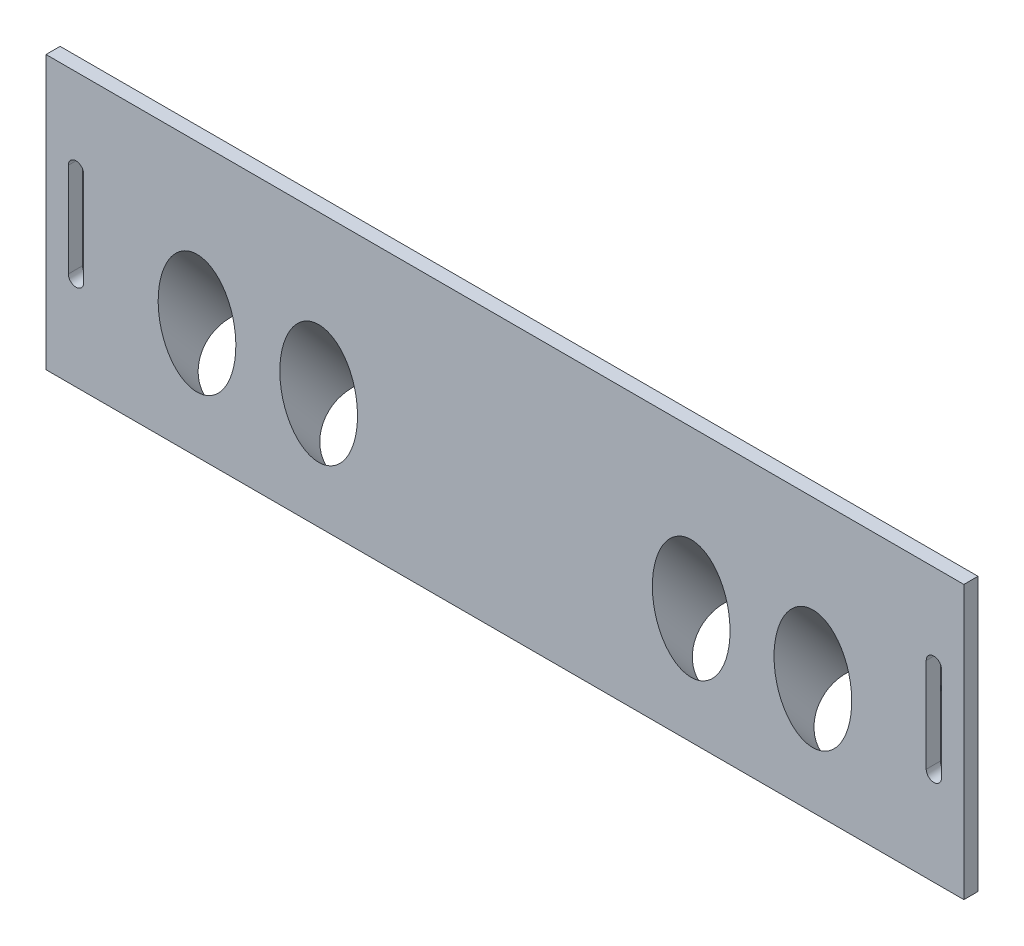
ISO-10303-21;
HEADER;
FILE_DESCRIPTION(('STEP AP214'),'2;1');
FILE_NAME('part.step','',(''),(''),'','','');
FILE_SCHEMA(('AUTOMOTIVE_DESIGN { 1 0 10303 214 1 1 1 1 }'));
ENDSEC;
DATA;
#1=APPLICATION_CONTEXT('core data for automotive mechanical design processes');
#2=APPLICATION_PROTOCOL_DEFINITION('international standard','automotive_design',2000,#1);
#3=PRODUCT_CONTEXT('',#1,'mechanical');
#4=PRODUCT('Part','Part','',(#3));
#5=PRODUCT_RELATED_PRODUCT_CATEGORY('part','',(#4));
#6=PRODUCT_DEFINITION_FORMATION('','',#4);
#7=PRODUCT_DEFINITION_CONTEXT('part definition',#1,'design');
#8=PRODUCT_DEFINITION('design','',#6,#7);
#9=PRODUCT_DEFINITION_SHAPE('','',#8);
#10=(LENGTH_UNIT() NAMED_UNIT(*) SI_UNIT(.MILLI.,.METRE.));
#11=(NAMED_UNIT(*) PLANE_ANGLE_UNIT() SI_UNIT($,.RADIAN.));
#12=(NAMED_UNIT(*) SI_UNIT($,.STERADIAN.) SOLID_ANGLE_UNIT());
#13=UNCERTAINTY_MEASURE_WITH_UNIT(LENGTH_MEASURE(1.E-05),#10,'distance_accuracy_value','');
#14=(GEOMETRIC_REPRESENTATION_CONTEXT(3) GLOBAL_UNCERTAINTY_ASSIGNED_CONTEXT((#13)) GLOBAL_UNIT_ASSIGNED_CONTEXT((#10,
#11,#12)) REPRESENTATION_CONTEXT('',''));
#15=CARTESIAN_POINT('',(0.,0.,0.));
#16=DIRECTION('',(0.,0.,1.));
#17=DIRECTION('',(1.,0.,0.));
#18=AXIS2_PLACEMENT_3D('',#15,#16,#17);
#19=CARTESIAN_POINT('',(91.125,15.,3.));
#20=DIRECTION('',(0.,0.,-1.));
#21=DIRECTION('',(-1.,0.,0.));
#22=AXIS2_PLACEMENT_3D('',#19,#20,#21);
#23=CYLINDRICAL_SURFACE('',#22,1.625);
#24=CARTESIAN_POINT('',(91.125,15.,3.));
#25=DIRECTION('',(0.,0.,1.));
#26=DIRECTION('',(1.,0.,0.));
#27=AXIS2_PLACEMENT_3D('',#24,#25,#26);
#28=CIRCLE('',#27,1.625);
#29=CARTESIAN_POINT('',(89.5,15.,3.));
#30=VERTEX_POINT('',#29);
#31=CARTESIAN_POINT('',(92.75,15.,3.));
#32=VERTEX_POINT('',#31);
#33=EDGE_CURVE('E184',#30,#32,#28,.T.);
#34=ORIENTED_EDGE('',*,*,#33,.T.);
#35=DIRECTION('',(0.,0.,-1.));
#36=VECTOR('',#35,1.);
#37=CARTESIAN_POINT('',(92.75,15.,3.));
#38=LINE('',#37,#36);
#39=CARTESIAN_POINT('',(92.75,15.,0.));
#40=VERTEX_POINT('',#39);
#41=EDGE_CURVE('E170',#32,#40,#38,.T.);
#42=ORIENTED_EDGE('',*,*,#41,.T.);
#43=CARTESIAN_POINT('',(91.125,15.,0.));
#44=DIRECTION('',(0.,0.,1.));
#45=DIRECTION('',(1.,0.,0.));
#46=AXIS2_PLACEMENT_3D('',#43,#44,#45);
#47=CIRCLE('',#46,1.625);
#48=CARTESIAN_POINT('',(89.5,15.,0.));
#49=VERTEX_POINT('',#48);
#50=EDGE_CURVE('E178',#49,#40,#47,.T.);
#51=ORIENTED_EDGE('',*,*,#50,.F.);
#52=DIRECTION('',(0.,0.,-1.));
#53=VECTOR('',#52,1.);
#54=CARTESIAN_POINT('',(89.5,15.,3.));
#55=LINE('',#54,#53);
#56=EDGE_CURVE('E161',#30,#49,#55,.T.);
#57=ORIENTED_EDGE('',*,*,#56,.F.);
#58=EDGE_LOOP('',(#34,#42,#51,#57));
#59=FACE_BOUND('',#58,.T.);
#60=ADVANCED_FACE('F38',(#59),#23,.F.);
#61=CARTESIAN_POINT('',(0.,0.,0.));
#62=DIRECTION('',(0.,0.,1.));
#63=DIRECTION('',(1.,0.,0.));
#64=AXIS2_PLACEMENT_3D('',#61,#62,#63);
#65=PLANE('',#64);
#66=CARTESIAN_POINT('',(-91.125,35.,0.));
#67=DIRECTION('',(0.,0.,-1.));
#68=DIRECTION('',(1.,0.,0.));
#69=AXIS2_PLACEMENT_3D('',#66,#67,#68);
#70=CIRCLE('',#69,1.625);
#71=CARTESIAN_POINT('',(-92.75,35.,0.));
#72=VERTEX_POINT('',#71);
#73=CARTESIAN_POINT('',(-89.5,35.,0.));
#74=VERTEX_POINT('',#73);
#75=EDGE_CURVE('E334',#72,#74,#70,.T.);
#76=ORIENTED_EDGE('',*,*,#75,.F.);
#77=DIRECTION('',(0.,1.,0.));
#78=VECTOR('',#77,1.);
#79=CARTESIAN_POINT('',(-92.75,15.,0.));
#80=LINE('',#79,#78);
#81=CARTESIAN_POINT('',(-92.75,15.,0.));
#82=VERTEX_POINT('',#81);
#83=EDGE_CURVE('E220',#82,#72,#80,.T.);
#84=ORIENTED_EDGE('',*,*,#83,.F.);
#85=CARTESIAN_POINT('',(-91.125,15.,0.));
#86=DIRECTION('',(0.,0.,1.));
#87=DIRECTION('',(-1.,0.,0.));
#88=AXIS2_PLACEMENT_3D('',#85,#86,#87);
#89=CIRCLE('',#88,1.625);
#90=CARTESIAN_POINT('',(-89.5,15.,0.));
#91=VERTEX_POINT('',#90);
#92=EDGE_CURVE('E190',#82,#91,#89,.T.);
#93=ORIENTED_EDGE('',*,*,#92,.T.);
#94=DIRECTION('',(0.,-1.,0.));
#95=VECTOR('',#94,1.);
#96=CARTESIAN_POINT('',(-89.5,35.,0.));
#97=LINE('',#96,#95);
#98=EDGE_CURVE('E61',#74,#91,#97,.T.);
#99=ORIENTED_EDGE('',*,*,#98,.F.);
#100=EDGE_LOOP('',(#76,#84,#93,#99));
#101=FACE_BOUND('',#100,.T.);
#102=ORIENTED_EDGE('',*,*,#50,.T.);
#103=DIRECTION('',(0.,-1.,0.));
#104=VECTOR('',#103,1.);
#105=CARTESIAN_POINT('',(92.75,15.,0.));
#106=LINE('',#105,#104);
#107=CARTESIAN_POINT('',(92.75,35.,0.));
#108=VERTEX_POINT('',#107);
#109=EDGE_CURVE('E341',#108,#40,#106,.T.);
#110=ORIENTED_EDGE('',*,*,#109,.F.);
#111=CARTESIAN_POINT('',(91.125,35.,0.));
#112=DIRECTION('',(0.,0.,-1.));
#113=DIRECTION('',(-1.,0.,0.));
#114=AXIS2_PLACEMENT_3D('',#111,#112,#113);
#115=CIRCLE('',#114,1.625);
#116=CARTESIAN_POINT('',(89.5,35.,0.));
#117=VERTEX_POINT('',#116);
#118=EDGE_CURVE('E180',#117,#108,#115,.T.);
#119=ORIENTED_EDGE('',*,*,#118,.F.);
#120=DIRECTION('',(0.,1.,0.));
#121=VECTOR('',#120,1.);
#122=CARTESIAN_POINT('',(89.5,35.,0.));
#123=LINE('',#122,#121);
#124=EDGE_CURVE('E164',#49,#117,#123,.T.);
#125=ORIENTED_EDGE('',*,*,#124,.F.);
#126=EDGE_LOOP('',(#102,#110,#119,#125));
#127=FACE_BOUND('',#126,.T.);
#128=DIRECTION('',(0.,1.,0.));
#129=VECTOR('',#128,1.);
#130=CARTESIAN_POINT('',(97.5,0.,0.));
#131=LINE('',#130,#129);
#132=CARTESIAN_POINT('',(97.5,-5.,0.));
#133=VERTEX_POINT('',#132);
#134=CARTESIAN_POINT('',(97.5,53.,0.));
#135=VERTEX_POINT('',#134);
#136=EDGE_CURVE('E187',#133,#135,#131,.T.);
#137=ORIENTED_EDGE('',*,*,#136,.F.);
#138=DIRECTION('',(1.,0.,0.));
#139=VECTOR('',#138,1.);
#140=CARTESIAN_POINT('',(-97.5,-5.,0.));
#141=LINE('',#140,#139);
#142=CARTESIAN_POINT('',(-97.5,-5.,0.));
#143=VERTEX_POINT('',#142);
#144=EDGE_CURVE('E274',#143,#133,#141,.T.);
#145=ORIENTED_EDGE('',*,*,#144,.F.);
#146=DIRECTION('',(0.,-1.,0.));
#147=VECTOR('',#146,1.);
#148=CARTESIAN_POINT('',(-97.5,0.,0.));
#149=LINE('',#148,#147);
#150=CARTESIAN_POINT('',(-97.5,53.,0.));
#151=VERTEX_POINT('',#150);
#152=EDGE_CURVE('E197',#151,#143,#149,.T.);
#153=ORIENTED_EDGE('',*,*,#152,.F.);
#154=DIRECTION('',(-1.,0.,0.));
#155=VECTOR('',#154,1.);
#156=CARTESIAN_POINT('',(-97.5,53.,0.));
#157=LINE('',#156,#155);
#158=EDGE_CURVE('E244',#135,#151,#157,.T.);
#159=ORIENTED_EDGE('',*,*,#158,.F.);
#160=EDGE_LOOP('',(#137,#145,#153,#159));
#161=FACE_BOUND('',#160,.T.);
#162=DIRECTION('',(-1.,0.,0.));
#163=VECTOR('',#162,1.);
#164=CARTESIAN_POINT('',(75.,0.738403156956422,0.));
#165=LINE('',#164,#163);
#166=CARTESIAN_POINT('',(75.,0.738403156956422,0.));
#167=VERTEX_POINT('',#166);
#168=CARTESIAN_POINT('',(30.,0.738403156956422,0.));
#169=VERTEX_POINT('',#168);
#170=EDGE_CURVE('E315',#167,#169,#165,.T.);
#171=ORIENTED_EDGE('',*,*,#170,.F.);
#172=DIRECTION('',(0.,1.,0.));
#173=VECTOR('',#172,1.);
#174=CARTESIAN_POINT('',(75.,0.,0.));
#175=LINE('',#174,#173);
#176=CARTESIAN_POINT('',(75.,31.4710281893794,0.));
#177=VERTEX_POINT('',#176);
#178=EDGE_CURVE('E313',#167,#177,#175,.T.);
#179=ORIENTED_EDGE('',*,*,#178,.T.);
#180=DIRECTION('',(-1.,0.,0.));
#181=VECTOR('',#180,1.);
#182=CARTESIAN_POINT('',(75.,31.4710281893794,0.));
#183=LINE('',#182,#181);
#184=CARTESIAN_POINT('',(30.,31.4710281893794,0.));
#185=VERTEX_POINT('',#184);
#186=EDGE_CURVE('E325',#177,#185,#183,.T.);
#187=ORIENTED_EDGE('',*,*,#186,.T.);
#188=DIRECTION('',(0.,1.,0.));
#189=VECTOR('',#188,1.);
#190=CARTESIAN_POINT('',(30.,0.,0.));
#191=LINE('',#190,#189);
#192=EDGE_CURVE('E310',#169,#185,#191,.T.);
#193=ORIENTED_EDGE('',*,*,#192,.F.);
#194=EDGE_LOOP('',(#171,#179,#187,#193));
#195=FACE_BOUND('',#194,.T.);
#196=DIRECTION('',(0.,1.,0.));
#197=VECTOR('',#196,1.);
#198=CARTESIAN_POINT('',(-75.,31.4710281893794,0.));
#199=LINE('',#198,#197);
#200=CARTESIAN_POINT('',(-75.,0.738403156956422,0.));
#201=VERTEX_POINT('',#200);
#202=CARTESIAN_POINT('',(-75.,31.4710281893794,0.));
#203=VERTEX_POINT('',#202);
#204=EDGE_CURVE('E284',#201,#203,#199,.T.);
#205=ORIENTED_EDGE('',*,*,#204,.F.);
#206=DIRECTION('',(1.,0.,0.));
#207=VECTOR('',#206,1.);
#208=CARTESIAN_POINT('',(-75.,0.738403156956422,0.));
#209=LINE('',#208,#207);
#210=CARTESIAN_POINT('',(-30.,0.738403156956422,0.));
#211=VERTEX_POINT('',#210);
#212=EDGE_CURVE('E292',#201,#211,#209,.T.);
#213=ORIENTED_EDGE('',*,*,#212,.T.);
#214=DIRECTION('',(0.,1.,0.));
#215=VECTOR('',#214,1.);
#216=CARTESIAN_POINT('',(-30.,31.4710281893794,0.));
#217=LINE('',#216,#215);
#218=CARTESIAN_POINT('',(-30.,31.4710281893794,0.));
#219=VERTEX_POINT('',#218);
#220=EDGE_CURVE('E283',#211,#219,#217,.T.);
#221=ORIENTED_EDGE('',*,*,#220,.T.);
#222=DIRECTION('',(1.,0.,0.));
#223=VECTOR('',#222,1.);
#224=CARTESIAN_POINT('',(-75.,31.4710281893794,0.));
#225=LINE('',#224,#223);
#226=EDGE_CURVE('E303',#203,#219,#225,.T.);
#227=ORIENTED_EDGE('',*,*,#226,.F.);
#228=EDGE_LOOP('',(#205,#213,#221,#227));
#229=FACE_BOUND('',#228,.T.);
#230=ADVANCED_FACE('F175',(#101,#127,#161,#195,#229),#65,.F.);
#231=CARTESIAN_POINT('',(0.,0.,3.));
#232=DIRECTION('',(0.,0.,1.));
#233=DIRECTION('',(1.,0.,0.));
#234=AXIS2_PLACEMENT_3D('',#231,#232,#233);
#235=PLANE('',#234);
#236=DIRECTION('',(0.,1.,0.));
#237=VECTOR('',#236,1.);
#238=CARTESIAN_POINT('',(92.75,0.,3.));
#239=LINE('',#238,#237);
#240=CARTESIAN_POINT('',(92.75,35.,3.));
#241=VERTEX_POINT('',#240);
#242=EDGE_CURVE('E228',#32,#241,#239,.T.);
#243=ORIENTED_EDGE('',*,*,#242,.F.);
#244=ORIENTED_EDGE('',*,*,#33,.F.);
#245=DIRECTION('',(0.,-1.,0.));
#246=VECTOR('',#245,1.);
#247=CARTESIAN_POINT('',(89.5,0.,3.));
#248=LINE('',#247,#246);
#249=CARTESIAN_POINT('',(89.5,35.,3.));
#250=VERTEX_POINT('',#249);
#251=EDGE_CURVE('E53',#250,#30,#248,.T.);
#252=ORIENTED_EDGE('',*,*,#251,.F.);
#253=CARTESIAN_POINT('',(91.125,35.,3.));
#254=DIRECTION('',(0.,0.,1.));
#255=DIRECTION('',(1.,0.,0.));
#256=AXIS2_PLACEMENT_3D('',#253,#254,#255);
#257=CIRCLE('',#256,1.625);
#258=EDGE_CURVE('E11',#241,#250,#257,.T.);
#259=ORIENTED_EDGE('',*,*,#258,.F.);
#260=EDGE_LOOP('',(#243,#244,#252,#259));
#261=FACE_BOUND('',#260,.T.);
#262=DIRECTION('',(0.,-1.,0.));
#263=VECTOR('',#262,1.);
#264=CARTESIAN_POINT('',(-92.75,0.,3.));
#265=LINE('',#264,#263);
#266=CARTESIAN_POINT('',(-92.75,35.,3.));
#267=VERTEX_POINT('',#266);
#268=CARTESIAN_POINT('',(-92.75,15.,3.));
#269=VERTEX_POINT('',#268);
#270=EDGE_CURVE('E217',#267,#269,#265,.T.);
#271=ORIENTED_EDGE('',*,*,#270,.F.);
#272=CARTESIAN_POINT('',(-91.125,35.,3.));
#273=DIRECTION('',(0.,0.,1.));
#274=DIRECTION('',(1.,0.,0.));
#275=AXIS2_PLACEMENT_3D('',#272,#273,#274);
#276=CIRCLE('',#275,1.625);
#277=CARTESIAN_POINT('',(-89.5,35.,3.));
#278=VERTEX_POINT('',#277);
#279=EDGE_CURVE('E46',#278,#267,#276,.T.);
#280=ORIENTED_EDGE('',*,*,#279,.F.);
#281=DIRECTION('',(0.,1.,0.));
#282=VECTOR('',#281,1.);
#283=CARTESIAN_POINT('',(-89.5,0.,3.));
#284=LINE('',#283,#282);
#285=CARTESIAN_POINT('',(-89.5,15.,3.));
#286=VERTEX_POINT('',#285);
#287=EDGE_CURVE('E226',#286,#278,#284,.T.);
#288=ORIENTED_EDGE('',*,*,#287,.F.);
#289=CARTESIAN_POINT('',(-91.125,15.,3.));
#290=DIRECTION('',(0.,0.,1.));
#291=DIRECTION('',(-1.,0.,0.));
#292=AXIS2_PLACEMENT_3D('',#289,#290,#291);
#293=CIRCLE('',#292,1.625);
#294=EDGE_CURVE('E185',#269,#286,#293,.T.);
#295=ORIENTED_EDGE('',*,*,#294,.F.);
#296=EDGE_LOOP('',(#271,#280,#288,#295));
#297=FACE_BOUND('',#296,.T.);
#298=CARTESIAN_POINT('',(-65.42,19.604875731098,3.));
#299=DIRECTION('',(0.,0.,1.));
#300=DIRECTION('',(0.,-1.,0.));
#301=AXIS2_PLACEMENT_3D('',#298,#299,#300);
#302=ELLIPSE('',#301,12.6772078258745,8.25);
#303=CARTESIAN_POINT('',(-65.42,6.92766790522351,3.));
#304=VERTEX_POINT('',#303);
#305=EDGE_CURVE('E262',#304,#304,#302,.T.);
#306=ORIENTED_EDGE('',*,*,#305,.F.);
#307=EDGE_LOOP('',(#306));
#308=FACE_BOUND('',#307,.T.);
#309=CARTESIAN_POINT('',(-39.57,19.604875731098,3.));
#310=DIRECTION('',(0.,0.,1.));
#311=DIRECTION('',(0.,-1.,0.));
#312=AXIS2_PLACEMENT_3D('',#309,#310,#311);
#313=ELLIPSE('',#312,12.6772078258745,8.25);
#314=CARTESIAN_POINT('',(-39.57,6.92766790522351,3.));
#315=VERTEX_POINT('',#314);
#316=EDGE_CURVE('E251',#315,#315,#313,.T.);
#317=ORIENTED_EDGE('',*,*,#316,.F.);
#318=EDGE_LOOP('',(#317));
#319=FACE_BOUND('',#318,.T.);
#320=CARTESIAN_POINT('',(39.57,19.604875731098,3.));
#321=DIRECTION('',(0.,0.,1.));
#322=DIRECTION('',(0.,-1.,0.));
#323=AXIS2_PLACEMENT_3D('',#320,#321,#322);
#324=ELLIPSE('',#323,12.6772078258745,8.25);
#325=CARTESIAN_POINT('',(39.57,6.92766790522351,3.));
#326=VERTEX_POINT('',#325);
#327=EDGE_CURVE('E268',#326,#326,#324,.T.);
#328=ORIENTED_EDGE('',*,*,#327,.F.);
#329=EDGE_LOOP('',(#328));
#330=FACE_BOUND('',#329,.T.);
#331=CARTESIAN_POINT('',(65.42,19.604875731098,3.));
#332=DIRECTION('',(0.,0.,1.));
#333=DIRECTION('',(0.,-1.,0.));
#334=AXIS2_PLACEMENT_3D('',#331,#332,#333);
#335=ELLIPSE('',#334,12.6772078258745,8.25);
#336=CARTESIAN_POINT('',(65.42,6.92766790522351,3.));
#337=VERTEX_POINT('',#336);
#338=EDGE_CURVE('E265',#337,#337,#335,.T.);
#339=ORIENTED_EDGE('',*,*,#338,.F.);
#340=EDGE_LOOP('',(#339));
#341=FACE_BOUND('',#340,.T.);
#342=DIRECTION('',(0.,1.,0.));
#343=VECTOR('',#342,1.);
#344=CARTESIAN_POINT('',(97.5,0.,3.));
#345=LINE('',#344,#343);
#346=CARTESIAN_POINT('',(97.5,-5.,3.));
#347=VERTEX_POINT('',#346);
#348=CARTESIAN_POINT('',(97.5,53.,3.));
#349=VERTEX_POINT('',#348);
#350=EDGE_CURVE('E194',#347,#349,#345,.T.);
#351=ORIENTED_EDGE('',*,*,#350,.T.);
#352=DIRECTION('',(1.,0.,0.));
#353=VECTOR('',#352,1.);
#354=CARTESIAN_POINT('',(-97.5,53.,3.));
#355=LINE('',#354,#353);
#356=CARTESIAN_POINT('',(-97.5,53.,3.));
#357=VERTEX_POINT('',#356);
#358=EDGE_CURVE('E238',#357,#349,#355,.T.);
#359=ORIENTED_EDGE('',*,*,#358,.F.);
#360=DIRECTION('',(0.,-1.,0.));
#361=VECTOR('',#360,1.);
#362=CARTESIAN_POINT('',(-97.5,0.,3.));
#363=LINE('',#362,#361);
#364=CARTESIAN_POINT('',(-97.5,-5.,3.));
#365=VERTEX_POINT('',#364);
#366=EDGE_CURVE('E196',#357,#365,#363,.T.);
#367=ORIENTED_EDGE('',*,*,#366,.T.);
#368=DIRECTION('',(-1.,0.,0.));
#369=VECTOR('',#368,1.);
#370=CARTESIAN_POINT('',(-97.5,-5.,3.));
#371=LINE('',#370,#369);
#372=EDGE_CURVE('E280',#347,#365,#371,.T.);
#373=ORIENTED_EDGE('',*,*,#372,.F.);
#374=EDGE_LOOP('',(#351,#359,#367,#373));
#375=FACE_BOUND('',#374,.T.);
#376=ADVANCED_FACE('F224',(#261,#297,#308,#319,#330,#341,#375),#235,.T.);
#377=CARTESIAN_POINT('',(97.5,0.,3.));
#378=DIRECTION('',(-1.,0.,0.));
#379=DIRECTION('',(0.,0.,1.));
#380=AXIS2_PLACEMENT_3D('',#377,#378,#379);
#381=PLANE('',#380);
#382=ORIENTED_EDGE('',*,*,#136,.T.);
#383=DIRECTION('',(0.,0.,-1.));
#384=VECTOR('',#383,1.);
#385=CARTESIAN_POINT('',(97.5,53.,0.));
#386=LINE('',#385,#384);
#387=EDGE_CURVE('E241',#349,#135,#386,.T.);
#388=ORIENTED_EDGE('',*,*,#387,.F.);
#389=ORIENTED_EDGE('',*,*,#350,.F.);
#390=DIRECTION('',(0.,0.,1.));
#391=VECTOR('',#390,1.);
#392=CARTESIAN_POINT('',(97.5,-5.,3.));
#393=LINE('',#392,#391);
#394=EDGE_CURVE('E277',#133,#347,#393,.T.);
#395=ORIENTED_EDGE('',*,*,#394,.F.);
#396=EDGE_LOOP('',(#382,#388,#389,#395));
#397=FACE_BOUND('',#396,.T.);
#398=ADVANCED_FACE('F40',(#397),#381,.F.);
#399=CARTESIAN_POINT('',(-97.5,0.,3.));
#400=DIRECTION('',(1.,0.,0.));
#401=DIRECTION('',(0.,0.,-1.));
#402=AXIS2_PLACEMENT_3D('',#399,#400,#401);
#403=PLANE('',#402);
#404=ORIENTED_EDGE('',*,*,#152,.T.);
#405=DIRECTION('',(0.,0.,-1.));
#406=VECTOR('',#405,1.);
#407=CARTESIAN_POINT('',(-97.5,-5.,3.));
#408=LINE('',#407,#406);
#409=EDGE_CURVE('E271',#365,#143,#408,.T.);
#410=ORIENTED_EDGE('',*,*,#409,.F.);
#411=ORIENTED_EDGE('',*,*,#366,.F.);
#412=DIRECTION('',(0.,0.,1.));
#413=VECTOR('',#412,1.);
#414=CARTESIAN_POINT('',(-97.5,53.,0.));
#415=LINE('',#414,#413);
#416=EDGE_CURVE('E235',#151,#357,#415,.T.);
#417=ORIENTED_EDGE('',*,*,#416,.F.);
#418=EDGE_LOOP('',(#404,#410,#411,#417));
#419=FACE_BOUND('',#418,.T.);
#420=ADVANCED_FACE('F358',(#419),#403,.F.);
#421=CARTESIAN_POINT('',(-91.125,15.,3.));
#422=DIRECTION('',(0.,0.,-1.));
#423=DIRECTION('',(-1.,0.,0.));
#424=AXIS2_PLACEMENT_3D('',#421,#422,#423);
#425=CYLINDRICAL_SURFACE('',#424,1.625);
#426=DIRECTION('',(0.,0.,-1.));
#427=VECTOR('',#426,1.);
#428=CARTESIAN_POINT('',(-92.75,15.,3.));
#429=LINE('',#428,#427);
#430=EDGE_CURVE('E171',#269,#82,#429,.T.);
#431=ORIENTED_EDGE('',*,*,#430,.F.);
#432=ORIENTED_EDGE('',*,*,#294,.T.);
#433=DIRECTION('',(0.,0.,-1.));
#434=VECTOR('',#433,1.);
#435=CARTESIAN_POINT('',(-89.5,15.,3.));
#436=LINE('',#435,#434);
#437=EDGE_CURVE('E199',#286,#91,#436,.T.);
#438=ORIENTED_EDGE('',*,*,#437,.T.);
#439=ORIENTED_EDGE('',*,*,#92,.F.);
#440=EDGE_LOOP('',(#431,#432,#438,#439));
#441=FACE_BOUND('',#440,.T.);
#442=ADVANCED_FACE('F332',(#441),#425,.F.);
#443=CARTESIAN_POINT('',(75.,0.425684190719085,0.364855478327035));
#444=DIRECTION('',(0.,-0.75927130733488,-0.650774217265852));
#445=DIRECTION('',(0.,0.650774217265852,-0.75927130733488));
#446=AXIS2_PLACEMENT_3D('',#443,#444,#445);
#447=PLANE('',#446);
#448=CARTESIAN_POINT('',(39.57,7.24614532961494,-7.5927130733488));
#449=DIRECTION('',(0.,-0.75927130733488,-0.650774217265852));
#450=DIRECTION('',(0.,-0.650774217265852,0.75927130733488));
#451=AXIS2_PLACEMENT_3D('',#448,#449,#450);
#452=CIRCLE('',#451,8.25);
#453=CARTESIAN_POINT('',(39.57,1.87725803717167,-1.32872478783604));
#454=VERTEX_POINT('',#453);
#455=EDGE_CURVE('E255',#454,#454,#452,.T.);
#456=ORIENTED_EDGE('',*,*,#455,.F.);
#457=EDGE_LOOP('',(#456));
#458=FACE_BOUND('',#457,.T.);
#459=CARTESIAN_POINT('',(65.42,7.24614532961494,-7.5927130733488));
#460=DIRECTION('',(0.,-0.75927130733488,-0.650774217265852));
#461=DIRECTION('',(0.,-0.650774217265852,0.75927130733488));
#462=AXIS2_PLACEMENT_3D('',#459,#460,#461);
#463=CIRCLE('',#462,8.25);
#464=CARTESIAN_POINT('',(65.42,1.87725803717167,-1.32872478783604));
#465=VERTEX_POINT('',#464);
#466=EDGE_CURVE('E247',#465,#465,#463,.T.);
#467=ORIENTED_EDGE('',*,*,#466,.F.);
#468=EDGE_LOOP('',(#467));
#469=FACE_BOUND('',#468,.T.);
#470=DIRECTION('',(0.,-0.650774217265852,0.75927130733488));
#471=VECTOR('',#470,1.);
#472=CARTESIAN_POINT('',(30.,0.425684190719085,0.364855478327035));
#473=LINE('',#472,#471);
#474=CARTESIAN_POINT('',(30.,13.7538875022735,-15.1854261466976));
#475=VERTEX_POINT('',#474);
#476=EDGE_CURVE('E305',#475,#169,#473,.T.);
#477=ORIENTED_EDGE('',*,*,#476,.F.);
#478=DIRECTION('',(-1.,0.,0.));
#479=VECTOR('',#478,1.);
#480=CARTESIAN_POINT('',(75.,13.7538875022735,-15.1854261466976));
#481=LINE('',#480,#479);
#482=CARTESIAN_POINT('',(75.,13.7538875022735,-15.1854261466976));
#483=VERTEX_POINT('',#482);
#484=EDGE_CURVE('E327',#483,#475,#481,.T.);
#485=ORIENTED_EDGE('',*,*,#484,.F.);
#486=DIRECTION('',(0.,-0.650774217265852,0.75927130733488));
#487=VECTOR('',#486,1.);
#488=CARTESIAN_POINT('',(75.,0.425684190719085,0.364855478327035));
#489=LINE('',#488,#487);
#490=EDGE_CURVE('E306',#483,#167,#489,.T.);
#491=ORIENTED_EDGE('',*,*,#490,.T.);
#492=ORIENTED_EDGE('',*,*,#170,.T.);
#493=EDGE_LOOP('',(#477,#485,#491,#492));
#494=FACE_BOUND('',#493,.T.);
#495=ADVANCED_FACE('F370',(#458,#469,#494),#447,.T.);
#496=CARTESIAN_POINT('',(75.,13.3282033115544,-15.5502816250246));
#497=DIRECTION('',(0.,-0.650774217265852,0.75927130733488));
#498=DIRECTION('',(0.,-0.75927130733488,-0.650774217265852));
#499=AXIS2_PLACEMENT_3D('',#496,#497,#498);
#500=PLANE('',#499);
#501=DIRECTION('',(0.,0.75927130733488,0.650774217265852));
#502=VECTOR('',#501,1.);
#503=CARTESIAN_POINT('',(30.,13.3282033115544,-15.5502816250246));
#504=LINE('',#503,#502);
#505=EDGE_CURVE('E318',#475,#185,#504,.T.);
#506=ORIENTED_EDGE('',*,*,#505,.T.);
#507=ORIENTED_EDGE('',*,*,#186,.F.);
#508=DIRECTION('',(0.,0.75927130733488,0.650774217265852));
#509=VECTOR('',#508,1.);
#510=CARTESIAN_POINT('',(75.,13.3282033115544,-15.5502816250246));
#511=LINE('',#510,#509);
#512=EDGE_CURVE('E309',#483,#177,#511,.T.);
#513=ORIENTED_EDGE('',*,*,#512,.F.);
#514=ORIENTED_EDGE('',*,*,#484,.T.);
#515=EDGE_LOOP('',(#506,#507,#513,#514));
#516=FACE_BOUND('',#515,.T.);
#517=ADVANCED_FACE('F373',(#516),#500,.F.);
#518=CARTESIAN_POINT('',(75.,0.,0.));
#519=DIRECTION('',(1.,0.,0.));
#520=DIRECTION('',(0.,0.,-1.));
#521=AXIS2_PLACEMENT_3D('',#518,#519,#520);
#522=PLANE('',#521);
#523=ORIENTED_EDGE('',*,*,#490,.F.);
#524=ORIENTED_EDGE('',*,*,#512,.T.);
#525=ORIENTED_EDGE('',*,*,#178,.F.);
#526=EDGE_LOOP('',(#523,#524,#525));
#527=FACE_BOUND('',#526,.T.);
#528=ADVANCED_FACE('F377',(#527),#522,.T.);
#529=CARTESIAN_POINT('',(30.,0.,0.));
#530=DIRECTION('',(1.,0.,0.));
#531=DIRECTION('',(0.,0.,-1.));
#532=AXIS2_PLACEMENT_3D('',#529,#530,#531);
#533=PLANE('',#532);
#534=ORIENTED_EDGE('',*,*,#476,.T.);
#535=ORIENTED_EDGE('',*,*,#192,.T.);
#536=ORIENTED_EDGE('',*,*,#505,.F.);
#537=EDGE_LOOP('',(#534,#535,#536));
#538=FACE_BOUND('',#537,.T.);
#539=ADVANCED_FACE('F379',(#538),#533,.F.);
#540=CARTESIAN_POINT('',(-75.,13.7538875022735,-15.1854261466976));
#541=DIRECTION('',(0.,-0.650774217265852,0.75927130733488));
#542=DIRECTION('',(0.,-0.75927130733488,-0.650774217265852));
#543=AXIS2_PLACEMENT_3D('',#540,#541,#542);
#544=PLANE('',#543);
#545=DIRECTION('',(0.,-0.75927130733488,-0.650774217265852));
#546=VECTOR('',#545,1.);
#547=CARTESIAN_POINT('',(-30.,13.7538875022735,-15.1854261466976));
#548=LINE('',#547,#546);
#549=CARTESIAN_POINT('',(-30.,13.7538875022735,-15.1854261466976));
#550=VERTEX_POINT('',#549);
#551=EDGE_CURVE('E295',#219,#550,#548,.T.);
#552=ORIENTED_EDGE('',*,*,#551,.T.);
#553=DIRECTION('',(1.,0.,0.));
#554=VECTOR('',#553,1.);
#555=CARTESIAN_POINT('',(-75.,13.7538875022735,-15.1854261466976));
#556=LINE('',#555,#554);
#557=CARTESIAN_POINT('',(-75.,13.7538875022735,-15.1854261466976));
#558=VERTEX_POINT('',#557);
#559=EDGE_CURVE('E300',#558,#550,#556,.T.);
#560=ORIENTED_EDGE('',*,*,#559,.F.);
#561=DIRECTION('',(0.,-0.75927130733488,-0.650774217265852));
#562=VECTOR('',#561,1.);
#563=CARTESIAN_POINT('',(-75.,13.7538875022735,-15.1854261466976));
#564=LINE('',#563,#562);
#565=EDGE_CURVE('E287',#203,#558,#564,.T.);
#566=ORIENTED_EDGE('',*,*,#565,.F.);
#567=ORIENTED_EDGE('',*,*,#226,.T.);
#568=EDGE_LOOP('',(#552,#560,#566,#567));
#569=FACE_BOUND('',#568,.T.);
#570=ADVANCED_FACE('F382',(#569),#544,.F.);
#571=CARTESIAN_POINT('',(-75.,0.738403156956422,0.));
#572=DIRECTION('',(0.,0.75927130733488,0.650774217265852));
#573=DIRECTION('',(0.,-0.650774217265852,0.75927130733488));
#574=AXIS2_PLACEMENT_3D('',#571,#572,#573);
#575=PLANE('',#574);
#576=CARTESIAN_POINT('',(-65.42,7.24614532961494,-7.5927130733488));
#577=DIRECTION('',(0.,-0.75927130733488,-0.650774217265852));
#578=DIRECTION('',(0.,0.650774217265852,-0.75927130733488));
#579=AXIS2_PLACEMENT_3D('',#576,#577,#578);
#580=CIRCLE('',#579,8.25);
#581=CARTESIAN_POINT('',(-65.42,12.6150326220582,-13.8567013588616));
#582=VERTEX_POINT('',#581);
#583=EDGE_CURVE('E248',#582,#582,#580,.T.);
#584=ORIENTED_EDGE('',*,*,#583,.F.);
#585=EDGE_LOOP('',(#584));
#586=FACE_BOUND('',#585,.T.);
#587=CARTESIAN_POINT('',(-39.57,7.24614532961494,-7.5927130733488));
#588=DIRECTION('',(0.,-0.75927130733488,-0.650774217265852));
#589=DIRECTION('',(0.,0.650774217265852,-0.75927130733488));
#590=AXIS2_PLACEMENT_3D('',#587,#588,#589);
#591=CIRCLE('',#590,8.25);
#592=CARTESIAN_POINT('',(-39.57,12.6150326220582,-13.8567013588616));
#593=VERTEX_POINT('',#592);
#594=EDGE_CURVE('E252',#593,#593,#591,.T.);
#595=ORIENTED_EDGE('',*,*,#594,.F.);
#596=EDGE_LOOP('',(#595));
#597=FACE_BOUND('',#596,.T.);
#598=DIRECTION('',(0.,-0.650774217265852,0.75927130733488));
#599=VECTOR('',#598,1.);
#600=CARTESIAN_POINT('',(-30.,0.738403156956422,0.));
#601=LINE('',#600,#599);
#602=EDGE_CURVE('E288',#550,#211,#601,.T.);
#603=ORIENTED_EDGE('',*,*,#602,.T.);
#604=ORIENTED_EDGE('',*,*,#212,.F.);
#605=DIRECTION('',(0.,-0.650774217265852,0.75927130733488));
#606=VECTOR('',#605,1.);
#607=CARTESIAN_POINT('',(-75.,0.738403156956422,0.));
#608=LINE('',#607,#606);
#609=EDGE_CURVE('E290',#558,#201,#608,.T.);
#610=ORIENTED_EDGE('',*,*,#609,.F.);
#611=ORIENTED_EDGE('',*,*,#559,.T.);
#612=EDGE_LOOP('',(#603,#604,#610,#611));
#613=FACE_BOUND('',#612,.T.);
#614=ADVANCED_FACE('F389',(#586,#597,#613),#575,.F.);
#615=CARTESIAN_POINT('',(-75.,0.,0.));
#616=DIRECTION('',(1.,0.,0.));
#617=DIRECTION('',(0.,0.,-1.));
#618=AXIS2_PLACEMENT_3D('',#615,#616,#617);
#619=PLANE('',#618);
#620=ORIENTED_EDGE('',*,*,#204,.T.);
#621=ORIENTED_EDGE('',*,*,#565,.T.);
#622=ORIENTED_EDGE('',*,*,#609,.T.);
#623=EDGE_LOOP('',(#620,#621,#622));
#624=FACE_BOUND('',#623,.T.);
#625=ADVANCED_FACE('F393',(#624),#619,.F.);
#626=CARTESIAN_POINT('',(-30.,0.,0.));
#627=DIRECTION('',(1.,0.,0.));
#628=DIRECTION('',(0.,0.,-1.));
#629=AXIS2_PLACEMENT_3D('',#626,#627,#628);
#630=PLANE('',#629);
#631=ORIENTED_EDGE('',*,*,#220,.F.);
#632=ORIENTED_EDGE('',*,*,#602,.F.);
#633=ORIENTED_EDGE('',*,*,#551,.F.);
#634=EDGE_LOOP('',(#631,#632,#633));
#635=FACE_BOUND('',#634,.T.);
#636=ADVANCED_FACE('F395',(#635),#630,.T.);
#637=CARTESIAN_POINT('',(0.,-5.,0.));
#638=DIRECTION('',(0.,-1.,0.));
#639=DIRECTION('',(0.,0.,-1.));
#640=AXIS2_PLACEMENT_3D('',#637,#638,#639);
#641=PLANE('',#640);
#642=ORIENTED_EDGE('',*,*,#409,.T.);
#643=ORIENTED_EDGE('',*,*,#144,.T.);
#644=ORIENTED_EDGE('',*,*,#394,.T.);
#645=ORIENTED_EDGE('',*,*,#372,.T.);
#646=EDGE_LOOP('',(#642,#643,#644,#645));
#647=FACE_BOUND('',#646,.T.);
#648=ADVANCED_FACE('F398',(#647),#641,.T.);
#649=CARTESIAN_POINT('',(-39.57,30.2095346004623,12.0892919413826));
#650=DIRECTION('',(0.,-0.75927130733488,-0.650774217265852));
#651=DIRECTION('',(0.,0.650774217265852,-0.75927130733488));
#652=AXIS2_PLACEMENT_3D('',#649,#650,#651);
#653=CYLINDRICAL_SURFACE('',#652,8.25);
#654=ORIENTED_EDGE('',*,*,#316,.T.);
#655=EDGE_LOOP('',(#654));
#656=FACE_BOUND('',#655,.T.);
#657=ORIENTED_EDGE('',*,*,#594,.T.);
#658=EDGE_LOOP('',(#657));
#659=FACE_BOUND('',#658,.T.);
#660=ADVANCED_FACE('F405',(#656,#659),#653,.F.);
#661=CARTESIAN_POINT('',(-65.42,30.2095346004623,12.0892919413826));
#662=DIRECTION('',(0.,-0.75927130733488,-0.650774217265852));
#663=DIRECTION('',(0.,0.650774217265852,-0.75927130733488));
#664=AXIS2_PLACEMENT_3D('',#661,#662,#663);
#665=CYLINDRICAL_SURFACE('',#664,8.25);
#666=ORIENTED_EDGE('',*,*,#305,.T.);
#667=EDGE_LOOP('',(#666));
#668=FACE_BOUND('',#667,.T.);
#669=ORIENTED_EDGE('',*,*,#583,.T.);
#670=EDGE_LOOP('',(#669));
#671=FACE_BOUND('',#670,.T.);
#672=ADVANCED_FACE('F411',(#668,#671),#665,.F.);
#673=CARTESIAN_POINT('',(65.42,30.2095346004623,12.0892919413826));
#674=DIRECTION('',(0.,-0.75927130733488,-0.650774217265852));
#675=DIRECTION('',(0.,0.650774217265852,-0.75927130733488));
#676=AXIS2_PLACEMENT_3D('',#673,#674,#675);
#677=CYLINDRICAL_SURFACE('',#676,8.25);
#678=ORIENTED_EDGE('',*,*,#338,.T.);
#679=EDGE_LOOP('',(#678));
#680=FACE_BOUND('',#679,.T.);
#681=ORIENTED_EDGE('',*,*,#466,.T.);
#682=EDGE_LOOP('',(#681));
#683=FACE_BOUND('',#682,.T.);
#684=ADVANCED_FACE('F407',(#680,#683),#677,.F.);
#685=CARTESIAN_POINT('',(39.57,30.2095346004623,12.0892919413826));
#686=DIRECTION('',(0.,-0.75927130733488,-0.650774217265852));
#687=DIRECTION('',(0.,0.650774217265852,-0.75927130733488));
#688=AXIS2_PLACEMENT_3D('',#685,#686,#687);
#689=CYLINDRICAL_SURFACE('',#688,8.25);
#690=ORIENTED_EDGE('',*,*,#327,.T.);
#691=EDGE_LOOP('',(#690));
#692=FACE_BOUND('',#691,.T.);
#693=ORIENTED_EDGE('',*,*,#455,.T.);
#694=EDGE_LOOP('',(#693));
#695=FACE_BOUND('',#694,.T.);
#696=ADVANCED_FACE('F410',(#692,#695),#689,.F.);
#697=CARTESIAN_POINT('',(0.,53.,0.));
#698=DIRECTION('',(0.,1.,0.));
#699=DIRECTION('',(0.,0.,1.));
#700=AXIS2_PLACEMENT_3D('',#697,#698,#699);
#701=PLANE('',#700);
#702=ORIENTED_EDGE('',*,*,#416,.T.);
#703=ORIENTED_EDGE('',*,*,#358,.T.);
#704=ORIENTED_EDGE('',*,*,#387,.T.);
#705=ORIENTED_EDGE('',*,*,#158,.T.);
#706=EDGE_LOOP('',(#702,#703,#704,#705));
#707=FACE_BOUND('',#706,.T.);
#708=ADVANCED_FACE('F415',(#707),#701,.T.);
#709=CARTESIAN_POINT('',(-91.125,35.,15.));
#710=DIRECTION('',(0.,0.,-1.));
#711=DIRECTION('',(-1.,0.,0.));
#712=AXIS2_PLACEMENT_3D('',#709,#710,#711);
#713=CYLINDRICAL_SURFACE('',#712,1.625);
#714=ORIENTED_EDGE('',*,*,#279,.T.);
#715=DIRECTION('',(0.,0.,-1.));
#716=VECTOR('',#715,1.);
#717=CARTESIAN_POINT('',(-92.75,35.,15.));
#718=LINE('',#717,#716);
#719=EDGE_CURVE('E181',#267,#72,#718,.T.);
#720=ORIENTED_EDGE('',*,*,#719,.T.);
#721=ORIENTED_EDGE('',*,*,#75,.T.);
#722=DIRECTION('',(0.,0.,-1.));
#723=VECTOR('',#722,1.);
#724=CARTESIAN_POINT('',(-89.5,35.,15.));
#725=LINE('',#724,#723);
#726=EDGE_CURVE('E211',#278,#74,#725,.T.);
#727=ORIENTED_EDGE('',*,*,#726,.F.);
#728=EDGE_LOOP('',(#714,#720,#721,#727));
#729=FACE_BOUND('',#728,.T.);
#730=ADVANCED_FACE('F208',(#729),#713,.F.);
#731=CARTESIAN_POINT('',(-92.75,15.,15.));
#732=DIRECTION('',(-1.,0.,0.));
#733=DIRECTION('',(0.,0.,1.));
#734=AXIS2_PLACEMENT_3D('',#731,#732,#733);
#735=PLANE('',#734);
#736=ORIENTED_EDGE('',*,*,#270,.T.);
#737=ORIENTED_EDGE('',*,*,#430,.T.);
#738=ORIENTED_EDGE('',*,*,#83,.T.);
#739=ORIENTED_EDGE('',*,*,#719,.F.);
#740=EDGE_LOOP('',(#736,#737,#738,#739));
#741=FACE_BOUND('',#740,.T.);
#742=ADVANCED_FACE('F216',(#741),#735,.F.);
#743=CARTESIAN_POINT('',(-89.5,35.,15.));
#744=DIRECTION('',(1.,0.,0.));
#745=DIRECTION('',(0.,0.,-1.));
#746=AXIS2_PLACEMENT_3D('',#743,#744,#745);
#747=PLANE('',#746);
#748=ORIENTED_EDGE('',*,*,#287,.T.);
#749=ORIENTED_EDGE('',*,*,#726,.T.);
#750=ORIENTED_EDGE('',*,*,#98,.T.);
#751=ORIENTED_EDGE('',*,*,#437,.F.);
#752=EDGE_LOOP('',(#748,#749,#750,#751));
#753=FACE_BOUND('',#752,.T.);
#754=ADVANCED_FACE('F333',(#753),#747,.F.);
#755=CARTESIAN_POINT('',(92.75,15.,15.));
#756=DIRECTION('',(1.,0.,0.));
#757=DIRECTION('',(0.,0.,-1.));
#758=AXIS2_PLACEMENT_3D('',#755,#756,#757);
#759=PLANE('',#758);
#760=ORIENTED_EDGE('',*,*,#242,.T.);
#761=DIRECTION('',(0.,0.,-1.));
#762=VECTOR('',#761,1.);
#763=CARTESIAN_POINT('',(92.75,35.,15.));
#764=LINE('',#763,#762);
#765=EDGE_CURVE('E230',#241,#108,#764,.T.);
#766=ORIENTED_EDGE('',*,*,#765,.T.);
#767=ORIENTED_EDGE('',*,*,#109,.T.);
#768=ORIENTED_EDGE('',*,*,#41,.F.);
#769=EDGE_LOOP('',(#760,#766,#767,#768));
#770=FACE_BOUND('',#769,.T.);
#771=ADVANCED_FACE('F349',(#770),#759,.F.);
#772=CARTESIAN_POINT('',(91.125,35.,15.));
#773=DIRECTION('',(0.,0.,-1.));
#774=DIRECTION('',(-1.,0.,0.));
#775=AXIS2_PLACEMENT_3D('',#772,#773,#774);
#776=CYLINDRICAL_SURFACE('',#775,1.625);
#777=ORIENTED_EDGE('',*,*,#258,.T.);
#778=DIRECTION('',(0.,0.,-1.));
#779=VECTOR('',#778,1.);
#780=CARTESIAN_POINT('',(89.5,35.,15.));
#781=LINE('',#780,#779);
#782=EDGE_CURVE('E338',#250,#117,#781,.T.);
#783=ORIENTED_EDGE('',*,*,#782,.T.);
#784=ORIENTED_EDGE('',*,*,#118,.T.);
#785=ORIENTED_EDGE('',*,*,#765,.F.);
#786=EDGE_LOOP('',(#777,#783,#784,#785));
#787=FACE_BOUND('',#786,.T.);
#788=ADVANCED_FACE('F346',(#787),#776,.F.);
#789=CARTESIAN_POINT('',(89.5,35.,15.));
#790=DIRECTION('',(-1.,0.,0.));
#791=DIRECTION('',(0.,0.,1.));
#792=AXIS2_PLACEMENT_3D('',#789,#790,#791);
#793=PLANE('',#792);
#794=ORIENTED_EDGE('',*,*,#251,.T.);
#795=ORIENTED_EDGE('',*,*,#56,.T.);
#796=ORIENTED_EDGE('',*,*,#124,.T.);
#797=ORIENTED_EDGE('',*,*,#782,.F.);
#798=EDGE_LOOP('',(#794,#795,#796,#797));
#799=FACE_BOUND('',#798,.T.);
#800=ADVANCED_FACE('F163',(#799),#793,.F.);
#801=CLOSED_SHELL('',(#60,#230,#376,#398,#420,#442,#495,#517,#528,#539,#570,#614,#625,#636,#648,
#660,#672,#684,#696,#708,#730,#742,#754,#771,#788,#800));
#802=MANIFOLD_SOLID_BREP('B2',#801);
#803=ADVANCED_BREP_SHAPE_REPRESENTATION('',(#18,#802),#14);
#804=SHAPE_DEFINITION_REPRESENTATION(#9,#803);
ENDSEC;
END-ISO-10303-21;
